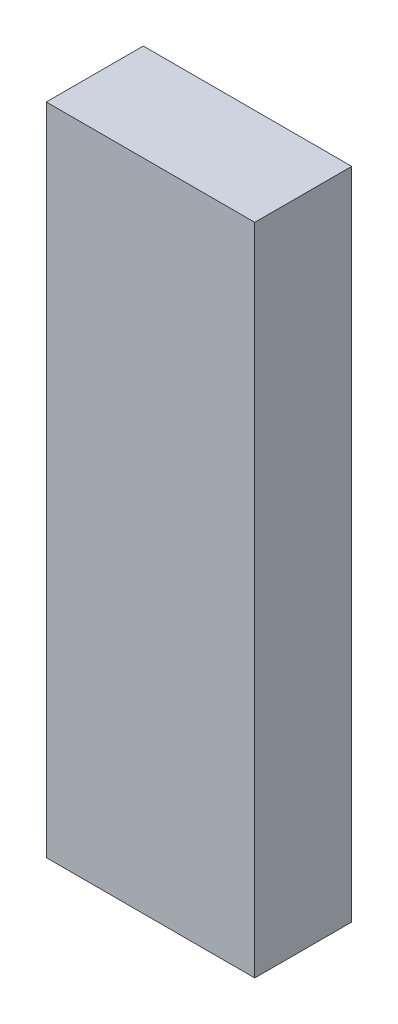
ISO-10303-21;
HEADER;
FILE_DESCRIPTION(('STEP AP214'),'2;1');
FILE_NAME('part.step','',(''),(''),'','','');
FILE_SCHEMA(('AUTOMOTIVE_DESIGN { 1 0 10303 214 1 1 1 1 }'));
ENDSEC;
DATA;
#1=APPLICATION_CONTEXT('core data for automotive mechanical design processes');
#2=APPLICATION_PROTOCOL_DEFINITION('international standard','automotive_design',2000,#1);
#3=PRODUCT_CONTEXT('',#1,'mechanical');
#4=PRODUCT('Part','Part','',(#3));
#5=PRODUCT_RELATED_PRODUCT_CATEGORY('part','',(#4));
#6=PRODUCT_DEFINITION_FORMATION('','',#4);
#7=PRODUCT_DEFINITION_CONTEXT('part definition',#1,'design');
#8=PRODUCT_DEFINITION('design','',#6,#7);
#9=PRODUCT_DEFINITION_SHAPE('','',#8);
#10=(LENGTH_UNIT() NAMED_UNIT(*) SI_UNIT(.MILLI.,.METRE.));
#11=(NAMED_UNIT(*) PLANE_ANGLE_UNIT() SI_UNIT($,.RADIAN.));
#12=(NAMED_UNIT(*) SI_UNIT($,.STERADIAN.) SOLID_ANGLE_UNIT());
#13=UNCERTAINTY_MEASURE_WITH_UNIT(LENGTH_MEASURE(1.E-05),#10,'distance_accuracy_value','');
#14=(GEOMETRIC_REPRESENTATION_CONTEXT(3) GLOBAL_UNCERTAINTY_ASSIGNED_CONTEXT((#13)) GLOBAL_UNIT_ASSIGNED_CONTEXT((#10,
#11,#12)) REPRESENTATION_CONTEXT('',''));
#15=CARTESIAN_POINT('',(0.,0.,0.));
#16=DIRECTION('',(0.,0.,1.));
#17=DIRECTION('',(1.,0.,0.));
#18=AXIS2_PLACEMENT_3D('',#15,#16,#17);
#19=CARTESIAN_POINT('',(140.689656408088,-45.5724762718831,20.));
#20=DIRECTION('',(1.,0.,0.));
#21=DIRECTION('',(0.,0.,-1.));
#22=AXIS2_PLACEMENT_3D('',#19,#20,#21);
#23=PLANE('',#22);
#24=DIRECTION('',(0.,-1.,0.));
#25=VECTOR('',#24,1.);
#26=CARTESIAN_POINT('',(140.689656408088,-45.5724762718831,0.));
#27=LINE('',#26,#25);
#28=CARTESIAN_POINT('',(140.689656408088,89.427523728117,0.));
#29=VERTEX_POINT('',#28);
#30=CARTESIAN_POINT('',(140.689656408088,-45.5724762718831,0.));
#31=VERTEX_POINT('',#30);
#32=EDGE_CURVE('E101',#29,#31,#27,.T.);
#33=ORIENTED_EDGE('',*,*,#32,.T.);
#34=DIRECTION('',(0.,0.,-1.));
#35=VECTOR('',#34,1.);
#36=CARTESIAN_POINT('',(140.689656408088,-45.5724762718831,20.));
#37=LINE('',#36,#35);
#38=CARTESIAN_POINT('',(140.689656408088,-45.5724762718831,20.));
#39=VERTEX_POINT('',#38);
#40=EDGE_CURVE('E11',#39,#31,#37,.T.);
#41=ORIENTED_EDGE('',*,*,#40,.F.);
#42=DIRECTION('',(0.,-1.,0.));
#43=VECTOR('',#42,1.);
#44=CARTESIAN_POINT('',(140.689656408088,-45.5724762718831,20.));
#45=LINE('',#44,#43);
#46=CARTESIAN_POINT('',(140.689656408088,89.427523728117,20.));
#47=VERTEX_POINT('',#46);
#48=EDGE_CURVE('E89',#47,#39,#45,.T.);
#49=ORIENTED_EDGE('',*,*,#48,.F.);
#50=DIRECTION('',(0.,0.,-1.));
#51=VECTOR('',#50,1.);
#52=CARTESIAN_POINT('',(140.689656408088,89.427523728117,20.));
#53=LINE('',#52,#51);
#54=EDGE_CURVE('E97',#47,#29,#53,.T.);
#55=ORIENTED_EDGE('',*,*,#54,.T.);
#56=EDGE_LOOP('',(#33,#41,#49,#55));
#57=FACE_BOUND('',#56,.T.);
#58=ADVANCED_FACE('F38',(#57),#23,.F.);
#59=CARTESIAN_POINT('',(140.689656408088,-45.5724762718831,20.));
#60=DIRECTION('',(0.,1.,0.));
#61=DIRECTION('',(-1.,0.,0.));
#62=AXIS2_PLACEMENT_3D('',#59,#60,#61);
#63=PLANE('',#62);
#64=DIRECTION('',(1.,0.,0.));
#65=VECTOR('',#64,1.);
#66=CARTESIAN_POINT('',(140.689656408088,-45.5724762718831,0.));
#67=LINE('',#66,#65);
#68=CARTESIAN_POINT('',(183.689656408089,-45.5724762718831,0.));
#69=VERTEX_POINT('',#68);
#70=EDGE_CURVE('E93',#31,#69,#67,.T.);
#71=ORIENTED_EDGE('',*,*,#70,.T.);
#72=DIRECTION('',(0.,0.,-1.));
#73=VECTOR('',#72,1.);
#74=CARTESIAN_POINT('',(183.689656408089,-45.5724762718831,20.));
#75=LINE('',#74,#73);
#76=CARTESIAN_POINT('',(183.689656408089,-45.5724762718831,20.));
#77=VERTEX_POINT('',#76);
#78=EDGE_CURVE('E46',#77,#69,#75,.T.);
#79=ORIENTED_EDGE('',*,*,#78,.F.);
#80=DIRECTION('',(1.,0.,0.));
#81=VECTOR('',#80,1.);
#82=CARTESIAN_POINT('',(140.689656408088,-45.5724762718831,20.));
#83=LINE('',#82,#81);
#84=EDGE_CURVE('E84',#39,#77,#83,.T.);
#85=ORIENTED_EDGE('',*,*,#84,.F.);
#86=ORIENTED_EDGE('',*,*,#40,.T.);
#87=EDGE_LOOP('',(#71,#79,#85,#86));
#88=FACE_BOUND('',#87,.T.);
#89=ADVANCED_FACE('F92',(#88),#63,.F.);
#90=CARTESIAN_POINT('',(183.689656408089,-45.5724762718831,20.));
#91=DIRECTION('',(-1.,0.,0.));
#92=DIRECTION('',(0.,0.,1.));
#93=AXIS2_PLACEMENT_3D('',#90,#91,#92);
#94=PLANE('',#93);
#95=DIRECTION('',(0.,1.,0.));
#96=VECTOR('',#95,1.);
#97=CARTESIAN_POINT('',(183.689656408089,-45.5724762718831,0.));
#98=LINE('',#97,#96);
#99=CARTESIAN_POINT('',(183.689656408089,89.427523728117,0.));
#100=VERTEX_POINT('',#99);
#101=EDGE_CURVE('E71',#69,#100,#98,.T.);
#102=ORIENTED_EDGE('',*,*,#101,.T.);
#103=DIRECTION('',(0.,0.,-1.));
#104=VECTOR('',#103,1.);
#105=CARTESIAN_POINT('',(183.689656408089,89.427523728117,20.));
#106=LINE('',#105,#104);
#107=CARTESIAN_POINT('',(183.689656408089,89.427523728117,20.));
#108=VERTEX_POINT('',#107);
#109=EDGE_CURVE('E94',#108,#100,#106,.T.);
#110=ORIENTED_EDGE('',*,*,#109,.F.);
#111=DIRECTION('',(0.,1.,0.));
#112=VECTOR('',#111,1.);
#113=CARTESIAN_POINT('',(183.689656408089,-45.5724762718831,20.));
#114=LINE('',#113,#112);
#115=EDGE_CURVE('E87',#77,#108,#114,.T.);
#116=ORIENTED_EDGE('',*,*,#115,.F.);
#117=ORIENTED_EDGE('',*,*,#78,.T.);
#118=EDGE_LOOP('',(#102,#110,#116,#117));
#119=FACE_BOUND('',#118,.T.);
#120=ADVANCED_FACE('F95',(#119),#94,.F.);
#121=CARTESIAN_POINT('',(140.689656408088,89.427523728117,20.));
#122=DIRECTION('',(0.,-1.,0.));
#123=DIRECTION('',(0.,0.,-1.));
#124=AXIS2_PLACEMENT_3D('',#121,#122,#123);
#125=PLANE('',#124);
#126=DIRECTION('',(-1.,0.,0.));
#127=VECTOR('',#126,1.);
#128=CARTESIAN_POINT('',(140.689656408088,89.427523728117,0.));
#129=LINE('',#128,#127);
#130=EDGE_CURVE('E77',#100,#29,#129,.T.);
#131=ORIENTED_EDGE('',*,*,#130,.T.);
#132=ORIENTED_EDGE('',*,*,#54,.F.);
#133=DIRECTION('',(-1.,0.,0.));
#134=VECTOR('',#133,1.);
#135=CARTESIAN_POINT('',(140.689656408088,89.427523728117,20.));
#136=LINE('',#135,#134);
#137=EDGE_CURVE('E54',#108,#47,#136,.T.);
#138=ORIENTED_EDGE('',*,*,#137,.F.);
#139=ORIENTED_EDGE('',*,*,#109,.T.);
#140=EDGE_LOOP('',(#131,#132,#138,#139));
#141=FACE_BOUND('',#140,.T.);
#142=ADVANCED_FACE('F108',(#141),#125,.F.);
#143=CARTESIAN_POINT('',(0.,0.,20.));
#144=DIRECTION('',(0.,0.,-1.));
#145=DIRECTION('',(-1.,0.,0.));
#146=AXIS2_PLACEMENT_3D('',#143,#144,#145);
#147=PLANE('',#146);
#148=ORIENTED_EDGE('',*,*,#48,.T.);
#149=ORIENTED_EDGE('',*,*,#84,.T.);
#150=ORIENTED_EDGE('',*,*,#115,.T.);
#151=ORIENTED_EDGE('',*,*,#137,.T.);
#152=EDGE_LOOP('',(#148,#149,#150,#151));
#153=FACE_BOUND('',#152,.T.);
#154=ADVANCED_FACE('F85',(#153),#147,.F.);
#155=CARTESIAN_POINT('',(0.,0.,0.));
#156=DIRECTION('',(0.,0.,-1.));
#157=DIRECTION('',(-1.,0.,0.));
#158=AXIS2_PLACEMENT_3D('',#155,#156,#157);
#159=PLANE('',#158);
#160=ORIENTED_EDGE('',*,*,#32,.F.);
#161=ORIENTED_EDGE('',*,*,#130,.F.);
#162=ORIENTED_EDGE('',*,*,#101,.F.);
#163=ORIENTED_EDGE('',*,*,#70,.F.);
#164=EDGE_LOOP('',(#160,#161,#162,#163));
#165=FACE_BOUND('',#164,.T.);
#166=ADVANCED_FACE('F111',(#165),#159,.T.);
#167=CLOSED_SHELL('',(#58,#89,#120,#142,#154,#166));
#168=MANIFOLD_SOLID_BREP('B2',#167);
#169=ADVANCED_BREP_SHAPE_REPRESENTATION('',(#18,#168),#14);
#170=SHAPE_DEFINITION_REPRESENTATION(#9,#169);
ENDSEC;
END-ISO-10303-21;
